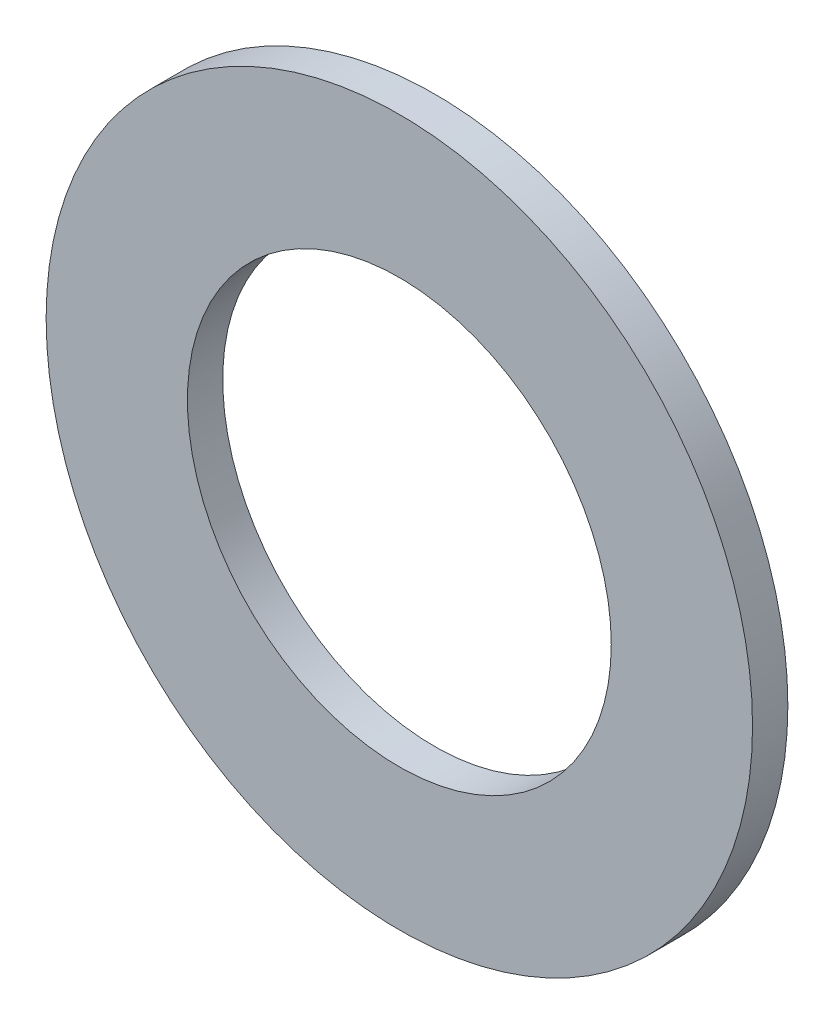
ISO-10303-21;
HEADER;
FILE_DESCRIPTION(('STEP AP214'),'2;1');
FILE_NAME('part.step','',(''),(''),'','','');
FILE_SCHEMA(('AUTOMOTIVE_DESIGN { 1 0 10303 214 1 1 1 1 }'));
ENDSEC;
DATA;
#1=APPLICATION_CONTEXT('core data for automotive mechanical design processes');
#2=APPLICATION_PROTOCOL_DEFINITION('international standard','automotive_design',2000,#1);
#3=PRODUCT_CONTEXT('',#1,'mechanical');
#4=PRODUCT('Part','Part','',(#3));
#5=PRODUCT_RELATED_PRODUCT_CATEGORY('part','',(#4));
#6=PRODUCT_DEFINITION_FORMATION('','',#4);
#7=PRODUCT_DEFINITION_CONTEXT('part definition',#1,'design');
#8=PRODUCT_DEFINITION('design','',#6,#7);
#9=PRODUCT_DEFINITION_SHAPE('','',#8);
#10=(LENGTH_UNIT() NAMED_UNIT(*) SI_UNIT(.MILLI.,.METRE.));
#11=(NAMED_UNIT(*) PLANE_ANGLE_UNIT() SI_UNIT($,.RADIAN.));
#12=(NAMED_UNIT(*) SI_UNIT($,.STERADIAN.) SOLID_ANGLE_UNIT());
#13=UNCERTAINTY_MEASURE_WITH_UNIT(LENGTH_MEASURE(1.E-05),#10,'distance_accuracy_value','');
#14=(GEOMETRIC_REPRESENTATION_CONTEXT(3) GLOBAL_UNCERTAINTY_ASSIGNED_CONTEXT((#13)) GLOBAL_UNIT_ASSIGNED_CONTEXT((#10,
#11,#12)) REPRESENTATION_CONTEXT('',''));
#15=CARTESIAN_POINT('',(0.,0.,0.));
#16=DIRECTION('',(0.,0.,1.));
#17=DIRECTION('',(1.,0.,0.));
#18=AXIS2_PLACEMENT_3D('',#15,#16,#17);
#19=CARTESIAN_POINT('',(0.,0.,0.));
#20=DIRECTION('',(0.,0.,-1.));
#21=DIRECTION('',(-1.,0.,0.));
#22=AXIS2_PLACEMENT_3D('',#19,#20,#21);
#23=PLANE('',#22);
#24=CARTESIAN_POINT('',(0.,0.,0.));
#25=DIRECTION('',(0.,0.,1.));
#26=DIRECTION('',(1.,0.,0.));
#27=AXIS2_PLACEMENT_3D('',#24,#25,#26);
#28=CIRCLE('',#27,19.05);
#29=CARTESIAN_POINT('',(19.05,0.,0.));
#30=VERTEX_POINT('',#29);
#31=EDGE_CURVE('E27',#30,#30,#28,.T.);
#32=ORIENTED_EDGE('',*,*,#31,.T.);
#33=EDGE_LOOP('',(#32));
#34=FACE_BOUND('',#33,.T.);
#35=CARTESIAN_POINT('',(0.,0.,0.));
#36=DIRECTION('',(0.,0.,1.));
#37=DIRECTION('',(1.,0.,0.));
#38=AXIS2_PLACEMENT_3D('',#35,#36,#37);
#39=CIRCLE('',#38,31.75);
#40=CARTESIAN_POINT('',(31.75,0.,0.));
#41=VERTEX_POINT('',#40);
#42=EDGE_CURVE('E18',#41,#41,#39,.T.);
#43=ORIENTED_EDGE('',*,*,#42,.F.);
#44=EDGE_LOOP('',(#43));
#45=FACE_BOUND('',#44,.T.);
#46=ADVANCED_FACE('F15',(#34,#45),#23,.T.);
#47=CARTESIAN_POINT('',(0.,0.,0.));
#48=DIRECTION('',(0.,0.,1.));
#49=DIRECTION('',(1.,0.,0.));
#50=AXIS2_PLACEMENT_3D('',#47,#48,#49);
#51=CYLINDRICAL_SURFACE('',#50,31.75);
#52=ORIENTED_EDGE('',*,*,#42,.T.);
#53=EDGE_LOOP('',(#52));
#54=FACE_BOUND('',#53,.T.);
#55=CARTESIAN_POINT('',(0.,0.,3.175));
#56=DIRECTION('',(0.,0.,1.));
#57=DIRECTION('',(1.,0.,0.));
#58=AXIS2_PLACEMENT_3D('',#55,#56,#57);
#59=CIRCLE('',#58,31.75);
#60=CARTESIAN_POINT('',(31.75,0.,3.175));
#61=VERTEX_POINT('',#60);
#62=EDGE_CURVE('E22',#61,#61,#59,.F.);
#63=ORIENTED_EDGE('',*,*,#62,.T.);
#64=EDGE_LOOP('',(#63));
#65=FACE_BOUND('',#64,.T.);
#66=ADVANCED_FACE('F35',(#54,#65),#51,.T.);
#67=CARTESIAN_POINT('',(0.,0.,0.));
#68=DIRECTION('',(0.,0.,1.));
#69=DIRECTION('',(1.,0.,0.));
#70=AXIS2_PLACEMENT_3D('',#67,#68,#69);
#71=CYLINDRICAL_SURFACE('',#70,19.05);
#72=ORIENTED_EDGE('',*,*,#31,.F.);
#73=EDGE_LOOP('',(#72));
#74=FACE_BOUND('',#73,.T.);
#75=CARTESIAN_POINT('',(0.,0.,3.175));
#76=DIRECTION('',(0.,0.,1.));
#77=DIRECTION('',(1.,0.,0.));
#78=AXIS2_PLACEMENT_3D('',#75,#76,#77);
#79=CIRCLE('',#78,19.05);
#80=CARTESIAN_POINT('',(19.05,0.,3.175));
#81=VERTEX_POINT('',#80);
#82=EDGE_CURVE('E10',#81,#81,#79,.T.);
#83=ORIENTED_EDGE('',*,*,#82,.T.);
#84=EDGE_LOOP('',(#83));
#85=FACE_BOUND('',#84,.T.);
#86=ADVANCED_FACE('F43',(#74,#85),#71,.F.);
#87=CARTESIAN_POINT('',(0.,0.,3.175));
#88=DIRECTION('',(0.,0.,-1.));
#89=DIRECTION('',(-1.,0.,0.));
#90=AXIS2_PLACEMENT_3D('',#87,#88,#89);
#91=PLANE('',#90);
#92=ORIENTED_EDGE('',*,*,#82,.F.);
#93=EDGE_LOOP('',(#92));
#94=FACE_BOUND('',#93,.T.);
#95=ORIENTED_EDGE('',*,*,#62,.F.);
#96=EDGE_LOOP('',(#95));
#97=FACE_BOUND('',#96,.T.);
#98=ADVANCED_FACE('F44',(#94,#97),#91,.F.);
#99=CLOSED_SHELL('',(#46,#66,#86,#98));
#100=MANIFOLD_SOLID_BREP('B1',#99);
#101=ADVANCED_BREP_SHAPE_REPRESENTATION('',(#18,#100),#14);
#102=SHAPE_DEFINITION_REPRESENTATION(#9,#101);
ENDSEC;
END-ISO-10303-21;
